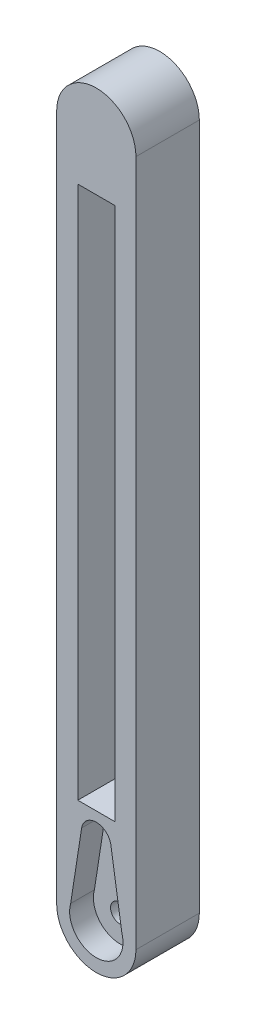
ISO-10303-21;
HEADER;
FILE_DESCRIPTION(('STEP AP214'),'2;1');
FILE_NAME('part.step','',(''),(''),'','','');
FILE_SCHEMA(('AUTOMOTIVE_DESIGN { 1 0 10303 214 1 1 1 1 }'));
ENDSEC;
DATA;
#1=APPLICATION_CONTEXT('core data for automotive mechanical design processes');
#2=APPLICATION_PROTOCOL_DEFINITION('international standard','automotive_design',2000,#1);
#3=PRODUCT_CONTEXT('',#1,'mechanical');
#4=PRODUCT('Part','Part','',(#3));
#5=PRODUCT_RELATED_PRODUCT_CATEGORY('part','',(#4));
#6=PRODUCT_DEFINITION_FORMATION('','',#4);
#7=PRODUCT_DEFINITION_CONTEXT('part definition',#1,'design');
#8=PRODUCT_DEFINITION('design','',#6,#7);
#9=PRODUCT_DEFINITION_SHAPE('','',#8);
#10=(LENGTH_UNIT() NAMED_UNIT(*) SI_UNIT(.MILLI.,.METRE.));
#11=(NAMED_UNIT(*) PLANE_ANGLE_UNIT() SI_UNIT($,.RADIAN.));
#12=(NAMED_UNIT(*) SI_UNIT($,.STERADIAN.) SOLID_ANGLE_UNIT());
#13=UNCERTAINTY_MEASURE_WITH_UNIT(LENGTH_MEASURE(1.E-05),#10,'distance_accuracy_value','');
#14=(GEOMETRIC_REPRESENTATION_CONTEXT(3) GLOBAL_UNCERTAINTY_ASSIGNED_CONTEXT((#13)) GLOBAL_UNIT_ASSIGNED_CONTEXT((#10,
#11,#12)) REPRESENTATION_CONTEXT('',''));
#15=CARTESIAN_POINT('',(0.,0.,0.));
#16=DIRECTION('',(0.,0.,1.));
#17=DIRECTION('',(1.,0.,0.));
#18=AXIS2_PLACEMENT_3D('',#15,#16,#17);
#19=CARTESIAN_POINT('',(1.85483870967741,-27.4193548387097,-1.5));
#20=DIRECTION('',(0.,0.,1.));
#21=DIRECTION('',(1.,0.,0.));
#22=AXIS2_PLACEMENT_3D('',#19,#20,#21);
#23=CYLINDRICAL_SURFACE('',#22,1.79999999999999);
#24=CARTESIAN_POINT('',(1.85483870967741,-27.4193548387097,7.5));
#25=DIRECTION('',(0.,0.,1.));
#26=DIRECTION('',(1.,0.,0.));
#27=AXIS2_PLACEMENT_3D('',#24,#25,#26);
#28=CIRCLE('',#27,1.79999999999999);
#29=CARTESIAN_POINT('',(3.65483870967741,-27.4193548387097,7.5));
#30=VERTEX_POINT('',#29);
#31=EDGE_CURVE('E167',#30,#30,#28,.T.);
#32=ORIENTED_EDGE('',*,*,#31,.T.);
#33=EDGE_LOOP('',(#32));
#34=FACE_BOUND('',#33,.T.);
#35=CARTESIAN_POINT('',(1.85483870967741,-27.4193548387097,2.));
#36=DIRECTION('',(0.,0.,-1.));
#37=DIRECTION('',(-1.,0.,0.));
#38=AXIS2_PLACEMENT_3D('',#35,#36,#37);
#39=CIRCLE('',#38,1.79999999999999);
#40=CARTESIAN_POINT('',(0.0548387096774171,-27.4193548387097,2.));
#41=VERTEX_POINT('',#40);
#42=EDGE_CURVE('E49',#41,#41,#39,.F.);
#43=ORIENTED_EDGE('',*,*,#42,.F.);
#44=EDGE_LOOP('',(#43));
#45=FACE_BOUND('',#44,.T.);
#46=ADVANCED_FACE('F45',(#34,#45),#23,.F.);
#47=CARTESIAN_POINT('',(1.85483870967741,102.58064516129,12.));
#48=DIRECTION('',(0.,0.,-1.));
#49=DIRECTION('',(-1.,0.,0.));
#50=AXIS2_PLACEMENT_3D('',#47,#48,#49);
#51=CYLINDRICAL_SURFACE('',#50,7.5);
#52=CARTESIAN_POINT('',(1.85483870967741,102.58064516129,0.));
#53=DIRECTION('',(0.,0.,1.));
#54=DIRECTION('',(-1.,0.,0.));
#55=AXIS2_PLACEMENT_3D('',#52,#53,#54);
#56=CIRCLE('',#55,7.5);
#57=CARTESIAN_POINT('',(9.35483870967741,102.58064516129,0.));
#58=VERTEX_POINT('',#57);
#59=CARTESIAN_POINT('',(-5.64516129032259,102.58064516129,0.));
#60=VERTEX_POINT('',#59);
#61=EDGE_CURVE('E248',#58,#60,#56,.T.);
#62=ORIENTED_EDGE('',*,*,#61,.T.);
#63=DIRECTION('',(0.,0.,-1.));
#64=VECTOR('',#63,1.);
#65=CARTESIAN_POINT('',(-5.64516129032259,102.58064516129,12.));
#66=LINE('',#65,#64);
#67=CARTESIAN_POINT('',(-5.64516129032259,102.58064516129,12.));
#68=VERTEX_POINT('',#67);
#69=EDGE_CURVE('E55',#68,#60,#66,.T.);
#70=ORIENTED_EDGE('',*,*,#69,.F.);
#71=CARTESIAN_POINT('',(1.85483870967741,102.58064516129,12.));
#72=DIRECTION('',(0.,0.,1.));
#73=DIRECTION('',(-1.,0.,0.));
#74=AXIS2_PLACEMENT_3D('',#71,#72,#73);
#75=CIRCLE('',#74,7.5);
#76=CARTESIAN_POINT('',(9.35483870967741,102.58064516129,12.));
#77=VERTEX_POINT('',#76);
#78=EDGE_CURVE('E252',#77,#68,#75,.T.);
#79=ORIENTED_EDGE('',*,*,#78,.F.);
#80=DIRECTION('',(0.,0.,-1.));
#81=VECTOR('',#80,1.);
#82=CARTESIAN_POINT('',(9.35483870967741,102.58064516129,12.));
#83=LINE('',#82,#81);
#84=EDGE_CURVE('E266',#77,#58,#83,.T.);
#85=ORIENTED_EDGE('',*,*,#84,.T.);
#86=EDGE_LOOP('',(#62,#70,#79,#85));
#87=FACE_BOUND('',#86,.T.);
#88=ADVANCED_FACE('F47',(#87),#51,.T.);
#89=CARTESIAN_POINT('',(-5.64516129032259,102.58064516129,12.));
#90=DIRECTION('',(1.,0.,0.));
#91=DIRECTION('',(0.,1.,0.));
#92=AXIS2_PLACEMENT_3D('',#89,#90,#91);
#93=PLANE('',#92);
#94=CARTESIAN_POINT('',(-5.64516129032259,78.768969581459,6.));
#95=DIRECTION('',(-1.,0.,0.));
#96=DIRECTION('',(0.,-1.,0.));
#97=AXIS2_PLACEMENT_3D('',#94,#95,#96);
#98=CIRCLE('',#97,5.15);
#99=CARTESIAN_POINT('',(-5.64516129032259,73.618969581459,6.));
#100=VERTEX_POINT('',#99);
#101=EDGE_CURVE('E206',#100,#100,#98,.T.);
#102=ORIENTED_EDGE('',*,*,#101,.F.);
#103=EDGE_LOOP('',(#102));
#104=FACE_BOUND('',#103,.T.);
#105=CARTESIAN_POINT('',(-5.64516129032258,53.768969581459,6.00000000000026));
#106=DIRECTION('',(-1.,0.,0.));
#107=DIRECTION('',(0.,-1.,0.));
#108=AXIS2_PLACEMENT_3D('',#105,#106,#107);
#109=CIRCLE('',#108,5.15);
#110=CARTESIAN_POINT('',(-5.64516129032258,48.618969581459,6.00000000000026));
#111=VERTEX_POINT('',#110);
#112=EDGE_CURVE('E210',#111,#111,#109,.T.);
#113=ORIENTED_EDGE('',*,*,#112,.F.);
#114=EDGE_LOOP('',(#113));
#115=FACE_BOUND('',#114,.T.);
#116=CARTESIAN_POINT('',(-5.64516129032258,28.768969581459,6.00000000000052));
#117=DIRECTION('',(-1.,0.,0.));
#118=DIRECTION('',(0.,-1.,0.));
#119=AXIS2_PLACEMENT_3D('',#116,#117,#118);
#120=CIRCLE('',#119,5.15);
#121=CARTESIAN_POINT('',(-5.64516129032258,23.618969581459,6.00000000000052));
#122=VERTEX_POINT('',#121);
#123=EDGE_CURVE('E218',#122,#122,#120,.T.);
#124=ORIENTED_EDGE('',*,*,#123,.F.);
#125=EDGE_LOOP('',(#124));
#126=FACE_BOUND('',#125,.T.);
#127=DIRECTION('',(0.,-1.,0.));
#128=VECTOR('',#127,1.);
#129=CARTESIAN_POINT('',(-5.64516129032259,102.58064516129,0.));
#130=LINE('',#129,#128);
#131=CARTESIAN_POINT('',(-5.64516129032258,-27.4193548387097,0.));
#132=VERTEX_POINT('',#131);
#133=EDGE_CURVE('E270',#60,#132,#130,.T.);
#134=ORIENTED_EDGE('',*,*,#133,.T.);
#135=DIRECTION('',(0.,0.,-1.));
#136=VECTOR('',#135,1.);
#137=CARTESIAN_POINT('',(-5.64516129032258,-27.4193548387097,12.));
#138=LINE('',#137,#136);
#139=CARTESIAN_POINT('',(-5.64516129032258,-27.4193548387097,12.));
#140=VERTEX_POINT('',#139);
#141=EDGE_CURVE('E285',#140,#132,#138,.T.);
#142=ORIENTED_EDGE('',*,*,#141,.F.);
#143=DIRECTION('',(0.,-1.,0.));
#144=VECTOR('',#143,1.);
#145=CARTESIAN_POINT('',(-5.64516129032259,102.58064516129,12.));
#146=LINE('',#145,#144);
#147=EDGE_CURVE('E256',#68,#140,#146,.T.);
#148=ORIENTED_EDGE('',*,*,#147,.F.);
#149=ORIENTED_EDGE('',*,*,#69,.T.);
#150=EDGE_LOOP('',(#134,#142,#148,#149));
#151=FACE_BOUND('',#150,.T.);
#152=ADVANCED_FACE('F293',(#104,#115,#126,#151),#93,.F.);
#153=CARTESIAN_POINT('',(1.85483870967743,-27.4193548387097,12.));
#154=DIRECTION('',(0.,0.,-1.));
#155=DIRECTION('',(-1.,0.,0.));
#156=AXIS2_PLACEMENT_3D('',#153,#154,#155);
#157=CYLINDRICAL_SURFACE('',#156,7.5);
#158=CARTESIAN_POINT('',(1.85483870967743,-27.4193548387097,0.));
#159=DIRECTION('',(0.,0.,1.));
#160=DIRECTION('',(1.,0.,0.));
#161=AXIS2_PLACEMENT_3D('',#158,#159,#160);
#162=CIRCLE('',#161,7.5);
#163=CARTESIAN_POINT('',(9.35483870967743,-27.4193548387097,0.));
#164=VERTEX_POINT('',#163);
#165=EDGE_CURVE('E273',#132,#164,#162,.T.);
#166=ORIENTED_EDGE('',*,*,#165,.T.);
#167=DIRECTION('',(0.,0.,-1.));
#168=VECTOR('',#167,1.);
#169=CARTESIAN_POINT('',(9.35483870967743,-27.4193548387097,12.));
#170=LINE('',#169,#168);
#171=CARTESIAN_POINT('',(9.35483870967743,-27.4193548387097,12.));
#172=VERTEX_POINT('',#171);
#173=EDGE_CURVE('E281',#172,#164,#170,.T.);
#174=ORIENTED_EDGE('',*,*,#173,.F.);
#175=CARTESIAN_POINT('',(1.85483870967743,-27.4193548387097,12.));
#176=DIRECTION('',(0.,0.,1.));
#177=DIRECTION('',(1.,0.,0.));
#178=AXIS2_PLACEMENT_3D('',#175,#176,#177);
#179=CIRCLE('',#178,7.5);
#180=EDGE_CURVE('E260',#140,#172,#179,.T.);
#181=ORIENTED_EDGE('',*,*,#180,.F.);
#182=ORIENTED_EDGE('',*,*,#141,.T.);
#183=EDGE_LOOP('',(#166,#174,#181,#182));
#184=FACE_BOUND('',#183,.T.);
#185=ADVANCED_FACE('F305',(#184),#157,.T.);
#186=CARTESIAN_POINT('',(9.35483870967741,102.58064516129,12.));
#187=DIRECTION('',(-1.,0.,0.));
#188=DIRECTION('',(0.,-1.,0.));
#189=AXIS2_PLACEMENT_3D('',#186,#187,#188);
#190=PLANE('',#189);
#191=DIRECTION('',(0.,1.,0.));
#192=VECTOR('',#191,1.);
#193=CARTESIAN_POINT('',(9.35483870967741,102.58064516129,0.));
#194=LINE('',#193,#192);
#195=EDGE_CURVE('E257',#164,#58,#194,.T.);
#196=ORIENTED_EDGE('',*,*,#195,.T.);
#197=ORIENTED_EDGE('',*,*,#84,.F.);
#198=DIRECTION('',(0.,1.,0.));
#199=VECTOR('',#198,1.);
#200=CARTESIAN_POINT('',(9.35483870967741,102.58064516129,12.));
#201=LINE('',#200,#199);
#202=EDGE_CURVE('E263',#172,#77,#201,.T.);
#203=ORIENTED_EDGE('',*,*,#202,.F.);
#204=ORIENTED_EDGE('',*,*,#173,.T.);
#205=EDGE_LOOP('',(#196,#197,#203,#204));
#206=FACE_BOUND('',#205,.T.);
#207=ADVANCED_FACE('F309',(#206),#190,.F.);
#208=CARTESIAN_POINT('',(1.85483870967741,102.58064516129,12.));
#209=DIRECTION('',(0.,0.,-1.));
#210=DIRECTION('',(-1.,0.,0.));
#211=AXIS2_PLACEMENT_3D('',#208,#209,#210);
#212=PLANE('',#211);
#213=DIRECTION('',(-0.153902862320071,0.988085982579294,0.));
#214=VECTOR('',#213,1.);
#215=CARTESIAN_POINT('',(6.69378472408306,-25.9617166517751,12.));
#216=LINE('',#215,#214);
#217=CARTESIAN_POINT('',(6.69378472408305,-25.9617166517751,12.));
#218=VERTEX_POINT('',#217);
#219=CARTESIAN_POINT('',(4.61141033989819,-12.5924725163662,12.));
#220=VERTEX_POINT('',#219);
#221=EDGE_CURVE('E176',#218,#220,#216,.T.);
#222=ORIENTED_EDGE('',*,*,#221,.F.);
#223=CARTESIAN_POINT('',(1.85483870967741,-27.4193548387097,12.));
#224=DIRECTION('',(0.,0.,1.));
#225=DIRECTION('',(1.,0.,0.));
#226=AXIS2_PLACEMENT_3D('',#223,#224,#225);
#227=CIRCLE('',#226,5.05372215444639);
#228=CARTESIAN_POINT('',(-2.99728743113241,-26.0062095779484,12.));
#229=VERTEX_POINT('',#228);
#230=EDGE_CURVE('E62',#229,#218,#227,.T.);
#231=ORIENTED_EDGE('',*,*,#230,.F.);
#232=DIRECTION('',(-0.152980997004391,-0.98822913059449,0.));
#233=VECTOR('',#232,1.);
#234=CARTESIAN_POINT('',(-0.920798481650618,-12.592472516367,12.));
#235=LINE('',#234,#233);
#236=CARTESIAN_POINT('',(-0.920798481650618,-12.592472516367,12.));
#237=VERTEX_POINT('',#236);
#238=EDGE_CURVE('E160',#237,#229,#235,.T.);
#239=ORIENTED_EDGE('',*,*,#238,.F.);
#240=CARTESIAN_POINT('',(1.84530592912386,-13.0759545909326,12.));
#241=DIRECTION('',(0.,0.,1.));
#242=DIRECTION('',(1.,0.,0.));
#243=AXIS2_PLACEMENT_3D('',#240,#241,#242);
#244=CIRCLE('',#243,2.80803997972469);
#245=EDGE_CURVE('E164',#220,#237,#244,.T.);
#246=ORIENTED_EDGE('',*,*,#245,.F.);
#247=EDGE_LOOP('',(#222,#231,#239,#246));
#248=FACE_BOUND('',#247,.T.);
#249=DIRECTION('',(-1.,0.,0.));
#250=VECTOR('',#249,1.);
#251=CARTESIAN_POINT('',(-2.3762908371189,-8.41500935941688,12.));
#252=LINE('',#251,#250);
#253=CARTESIAN_POINT('',(5.35483870967741,-8.41500935941688,12.));
#254=VERTEX_POINT('',#253);
#255=CARTESIAN_POINT('',(-1.64516129032259,-8.41500935941689,12.));
#256=VERTEX_POINT('',#255);
#257=EDGE_CURVE('E185',#254,#256,#252,.T.);
#258=ORIENTED_EDGE('',*,*,#257,.T.);
#259=DIRECTION('',(0.,-1.,0.));
#260=VECTOR('',#259,1.);
#261=CARTESIAN_POINT('',(-1.64516129032259,92.5806451612903,12.));
#262=LINE('',#261,#260);
#263=CARTESIAN_POINT('',(-1.64516129032259,92.5806451612903,12.));
#264=VERTEX_POINT('',#263);
#265=EDGE_CURVE('E229',#264,#256,#262,.T.);
#266=ORIENTED_EDGE('',*,*,#265,.F.);
#267=DIRECTION('',(-1.,0.,0.));
#268=VECTOR('',#267,1.);
#269=CARTESIAN_POINT('',(-1.64516129032259,92.5806451612903,12.));
#270=LINE('',#269,#268);
#271=CARTESIAN_POINT('',(5.35483870967741,92.5806451612903,12.));
#272=VERTEX_POINT('',#271);
#273=EDGE_CURVE('E239',#272,#264,#270,.T.);
#274=ORIENTED_EDGE('',*,*,#273,.F.);
#275=DIRECTION('',(0.,1.,0.));
#276=VECTOR('',#275,1.);
#277=CARTESIAN_POINT('',(5.35483870967741,92.5806451612903,12.));
#278=LINE('',#277,#276);
#279=EDGE_CURVE('E205',#254,#272,#278,.T.);
#280=ORIENTED_EDGE('',*,*,#279,.F.);
#281=EDGE_LOOP('',(#258,#266,#274,#280));
#282=FACE_BOUND('',#281,.T.);
#283=ORIENTED_EDGE('',*,*,#78,.T.);
#284=ORIENTED_EDGE('',*,*,#147,.T.);
#285=ORIENTED_EDGE('',*,*,#180,.T.);
#286=ORIENTED_EDGE('',*,*,#202,.T.);
#287=EDGE_LOOP('',(#283,#284,#285,#286));
#288=FACE_BOUND('',#287,.T.);
#289=ADVANCED_FACE('F311',(#248,#282,#288),#212,.F.);
#290=CARTESIAN_POINT('',(1.85483870967741,102.58064516129,0.));
#291=DIRECTION('',(0.,0.,-1.));
#292=DIRECTION('',(-1.,0.,0.));
#293=AXIS2_PLACEMENT_3D('',#290,#291,#292);
#294=PLANE('',#293);
#295=CARTESIAN_POINT('',(1.85483870967741,-27.4193548387097,0.));
#296=DIRECTION('',(0.,0.,-1.));
#297=DIRECTION('',(-1.,0.,0.));
#298=AXIS2_PLACEMENT_3D('',#295,#296,#297);
#299=CIRCLE('',#298,2.25);
#300=CARTESIAN_POINT('',(-0.395161290322588,-27.4193548387097,0.));
#301=VERTEX_POINT('',#300);
#302=EDGE_CURVE('E473',#301,#301,#299,.T.);
#303=ORIENTED_EDGE('',*,*,#302,.F.);
#304=EDGE_LOOP('',(#303));
#305=FACE_BOUND('',#304,.T.);
#306=DIRECTION('',(0.,-1.,0.));
#307=VECTOR('',#306,1.);
#308=CARTESIAN_POINT('',(-1.64516129032259,92.5806451612903,0.));
#309=LINE('',#308,#307);
#310=CARTESIAN_POINT('',(-1.64516129032259,92.5806451612903,0.));
#311=VERTEX_POINT('',#310);
#312=CARTESIAN_POINT('',(-1.64516129032259,-8.41500935941689,0.));
#313=VERTEX_POINT('',#312);
#314=EDGE_CURVE('E233',#311,#313,#309,.T.);
#315=ORIENTED_EDGE('',*,*,#314,.T.);
#316=DIRECTION('',(-1.,0.,0.));
#317=VECTOR('',#316,1.);
#318=CARTESIAN_POINT('',(-2.3762908371189,-8.41500935941688,0.));
#319=LINE('',#318,#317);
#320=CARTESIAN_POINT('',(5.35483870967741,-8.41500935941689,0.));
#321=VERTEX_POINT('',#320);
#322=EDGE_CURVE('E191',#321,#313,#319,.T.);
#323=ORIENTED_EDGE('',*,*,#322,.F.);
#324=DIRECTION('',(0.,1.,0.));
#325=VECTOR('',#324,1.);
#326=CARTESIAN_POINT('',(5.35483870967741,92.5806451612903,0.));
#327=LINE('',#326,#325);
#328=CARTESIAN_POINT('',(5.35483870967741,92.5806451612903,0.));
#329=VERTEX_POINT('',#328);
#330=EDGE_CURVE('E225',#321,#329,#327,.T.);
#331=ORIENTED_EDGE('',*,*,#330,.T.);
#332=DIRECTION('',(-1.,0.,0.));
#333=VECTOR('',#332,1.);
#334=CARTESIAN_POINT('',(-1.64516129032259,92.5806451612903,0.));
#335=LINE('',#334,#333);
#336=EDGE_CURVE('E228',#329,#311,#335,.T.);
#337=ORIENTED_EDGE('',*,*,#336,.T.);
#338=EDGE_LOOP('',(#315,#323,#331,#337));
#339=FACE_BOUND('',#338,.T.);
#340=ORIENTED_EDGE('',*,*,#61,.F.);
#341=ORIENTED_EDGE('',*,*,#195,.F.);
#342=ORIENTED_EDGE('',*,*,#165,.F.);
#343=ORIENTED_EDGE('',*,*,#133,.F.);
#344=EDGE_LOOP('',(#340,#341,#342,#343));
#345=FACE_BOUND('',#344,.T.);
#346=ADVANCED_FACE('F301',(#305,#339,#345),#294,.T.);
#347=CARTESIAN_POINT('',(-1.64516129032259,92.5806451612903,0.));
#348=DIRECTION('',(-1.,0.,0.));
#349=DIRECTION('',(0.,-1.,0.));
#350=AXIS2_PLACEMENT_3D('',#347,#348,#349);
#351=PLANE('',#350);
#352=ORIENTED_EDGE('',*,*,#265,.T.);
#353=DIRECTION('',(0.,0.,-1.));
#354=VECTOR('',#353,1.);
#355=CARTESIAN_POINT('',(-1.64516129032259,-8.41500935941689,0.));
#356=LINE('',#355,#354);
#357=EDGE_CURVE('E70',#256,#313,#356,.T.);
#358=ORIENTED_EDGE('',*,*,#357,.T.);
#359=ORIENTED_EDGE('',*,*,#314,.F.);
#360=DIRECTION('',(0.,0.,1.));
#361=VECTOR('',#360,1.);
#362=CARTESIAN_POINT('',(-1.64516129032259,92.5806451612903,0.));
#363=LINE('',#362,#361);
#364=EDGE_CURVE('E245',#311,#264,#363,.T.);
#365=ORIENTED_EDGE('',*,*,#364,.T.);
#366=EDGE_LOOP('',(#352,#358,#359,#365));
#367=FACE_BOUND('',#366,.T.);
#368=ADVANCED_FACE('F320',(#367),#351,.F.);
#369=CARTESIAN_POINT('',(-1.64516129032259,92.5806451612903,0.));
#370=DIRECTION('',(0.,1.,0.));
#371=DIRECTION('',(0.,0.,1.));
#372=AXIS2_PLACEMENT_3D('',#369,#370,#371);
#373=PLANE('',#372);
#374=ORIENTED_EDGE('',*,*,#273,.T.);
#375=ORIENTED_EDGE('',*,*,#364,.F.);
#376=ORIENTED_EDGE('',*,*,#336,.F.);
#377=DIRECTION('',(0.,0.,1.));
#378=VECTOR('',#377,1.);
#379=CARTESIAN_POINT('',(5.35483870967741,92.5806451612903,0.));
#380=LINE('',#379,#378);
#381=EDGE_CURVE('E236',#329,#272,#380,.T.);
#382=ORIENTED_EDGE('',*,*,#381,.T.);
#383=EDGE_LOOP('',(#374,#375,#376,#382));
#384=FACE_BOUND('',#383,.T.);
#385=ADVANCED_FACE('F384',(#384),#373,.F.);
#386=CARTESIAN_POINT('',(5.35483870967741,92.5806451612903,0.));
#387=DIRECTION('',(1.,0.,0.));
#388=DIRECTION('',(0.,0.,-1.));
#389=AXIS2_PLACEMENT_3D('',#386,#387,#388);
#390=PLANE('',#389);
#391=ORIENTED_EDGE('',*,*,#330,.F.);
#392=DIRECTION('',(0.,0.,1.));
#393=VECTOR('',#392,1.);
#394=CARTESIAN_POINT('',(5.35483870967741,-8.41500935941689,0.));
#395=LINE('',#394,#393);
#396=EDGE_CURVE('E11',#321,#254,#395,.T.);
#397=ORIENTED_EDGE('',*,*,#396,.T.);
#398=ORIENTED_EDGE('',*,*,#279,.T.);
#399=ORIENTED_EDGE('',*,*,#381,.F.);
#400=EDGE_LOOP('',(#391,#397,#398,#399));
#401=FACE_BOUND('',#400,.T.);
#402=ADVANCED_FACE('F377',(#401),#390,.F.);
#403=CARTESIAN_POINT('',(-3.64516129032258,28.768969581459,6.00000000000052));
#404=DIRECTION('',(-1.,0.,0.));
#405=DIRECTION('',(0.,-1.,0.));
#406=AXIS2_PLACEMENT_3D('',#403,#404,#405);
#407=CYLINDRICAL_SURFACE('',#406,5.15);
#408=CARTESIAN_POINT('',(-3.64516129032258,28.768969581459,6.00000000000052));
#409=DIRECTION('',(-1.,0.,0.));
#410=DIRECTION('',(0.,-1.,0.));
#411=AXIS2_PLACEMENT_3D('',#408,#409,#410);
#412=CIRCLE('',#411,5.15);
#413=CARTESIAN_POINT('',(-3.64516129032258,23.618969581459,6.00000000000052));
#414=VERTEX_POINT('',#413);
#415=EDGE_CURVE('E200',#414,#414,#412,.T.);
#416=ORIENTED_EDGE('',*,*,#415,.F.);
#417=EDGE_LOOP('',(#416));
#418=FACE_BOUND('',#417,.T.);
#419=ORIENTED_EDGE('',*,*,#123,.T.);
#420=EDGE_LOOP('',(#419));
#421=FACE_BOUND('',#420,.T.);
#422=ADVANCED_FACE('F374',(#418,#421),#407,.F.);
#423=CARTESIAN_POINT('',(-3.64516129032258,28.768969581459,6.00000000000052));
#424=DIRECTION('',(-1.,0.,0.));
#425=DIRECTION('',(0.,-1.,0.));
#426=AXIS2_PLACEMENT_3D('',#423,#424,#425);
#427=PLANE('',#426);
#428=ORIENTED_EDGE('',*,*,#415,.T.);
#429=EDGE_LOOP('',(#428));
#430=FACE_BOUND('',#429,.T.);
#431=ADVANCED_FACE('F369',(#430),#427,.T.);
#432=CARTESIAN_POINT('',(-3.64516129032258,53.768969581459,6.00000000000026));
#433=DIRECTION('',(-1.,0.,0.));
#434=DIRECTION('',(0.,-1.,0.));
#435=AXIS2_PLACEMENT_3D('',#432,#433,#434);
#436=CYLINDRICAL_SURFACE('',#435,5.15);
#437=CARTESIAN_POINT('',(-3.64516129032258,53.768969581459,6.00000000000026));
#438=DIRECTION('',(-1.,0.,0.));
#439=DIRECTION('',(0.,-1.,0.));
#440=AXIS2_PLACEMENT_3D('',#437,#438,#439);
#441=CIRCLE('',#440,5.15);
#442=CARTESIAN_POINT('',(-3.64516129032258,48.618969581459,6.00000000000026));
#443=VERTEX_POINT('',#442);
#444=EDGE_CURVE('E214',#443,#443,#441,.T.);
#445=ORIENTED_EDGE('',*,*,#444,.F.);
#446=EDGE_LOOP('',(#445));
#447=FACE_BOUND('',#446,.T.);
#448=ORIENTED_EDGE('',*,*,#112,.T.);
#449=EDGE_LOOP('',(#448));
#450=FACE_BOUND('',#449,.T.);
#451=ADVANCED_FACE('F366',(#447,#450),#436,.F.);
#452=CARTESIAN_POINT('',(-3.64516129032258,53.768969581459,6.00000000000026));
#453=DIRECTION('',(-1.,0.,0.));
#454=DIRECTION('',(0.,-1.,0.));
#455=AXIS2_PLACEMENT_3D('',#452,#453,#454);
#456=PLANE('',#455);
#457=ORIENTED_EDGE('',*,*,#444,.T.);
#458=EDGE_LOOP('',(#457));
#459=FACE_BOUND('',#458,.T.);
#460=ADVANCED_FACE('F364',(#459),#456,.T.);
#461=CARTESIAN_POINT('',(-3.64516129032259,78.768969581459,6.));
#462=DIRECTION('',(-1.,0.,0.));
#463=DIRECTION('',(0.,-1.,0.));
#464=AXIS2_PLACEMENT_3D('',#461,#462,#463);
#465=CYLINDRICAL_SURFACE('',#464,5.15);
#466=CARTESIAN_POINT('',(-3.64516129032259,78.768969581459,6.));
#467=DIRECTION('',(-1.,0.,0.));
#468=DIRECTION('',(0.,-1.,0.));
#469=AXIS2_PLACEMENT_3D('',#466,#467,#468);
#470=CIRCLE('',#469,5.15);
#471=CARTESIAN_POINT('',(-3.64516129032259,73.618969581459,6.));
#472=VERTEX_POINT('',#471);
#473=EDGE_CURVE('E201',#472,#472,#470,.T.);
#474=ORIENTED_EDGE('',*,*,#473,.F.);
#475=EDGE_LOOP('',(#474));
#476=FACE_BOUND('',#475,.T.);
#477=ORIENTED_EDGE('',*,*,#101,.T.);
#478=EDGE_LOOP('',(#477));
#479=FACE_BOUND('',#478,.T.);
#480=ADVANCED_FACE('F360',(#476,#479),#465,.F.);
#481=CARTESIAN_POINT('',(-3.64516129032259,78.768969581459,6.));
#482=DIRECTION('',(-1.,0.,0.));
#483=DIRECTION('',(0.,-1.,0.));
#484=AXIS2_PLACEMENT_3D('',#481,#482,#483);
#485=PLANE('',#484);
#486=ORIENTED_EDGE('',*,*,#473,.T.);
#487=EDGE_LOOP('',(#486));
#488=FACE_BOUND('',#487,.T.);
#489=ADVANCED_FACE('F356',(#488),#485,.T.);
#490=CARTESIAN_POINT('',(-2.3762908371189,-8.41500935941688,0.));
#491=DIRECTION('',(0.,1.,0.));
#492=DIRECTION('',(0.,0.,1.));
#493=AXIS2_PLACEMENT_3D('',#490,#491,#492);
#494=PLANE('',#493);
#495=ORIENTED_EDGE('',*,*,#357,.F.);
#496=ORIENTED_EDGE('',*,*,#257,.F.);
#497=ORIENTED_EDGE('',*,*,#396,.F.);
#498=ORIENTED_EDGE('',*,*,#322,.T.);
#499=EDGE_LOOP('',(#495,#496,#497,#498));
#500=FACE_BOUND('',#499,.T.);
#501=ADVANCED_FACE('F354',(#500),#494,.T.);
#502=CARTESIAN_POINT('',(1.85483870967741,-27.4193548387097,7.5));
#503=DIRECTION('',(0.,0.,1.));
#504=DIRECTION('',(1.,0.,0.));
#505=AXIS2_PLACEMENT_3D('',#502,#503,#504);
#506=CYLINDRICAL_SURFACE('',#505,5.05372215444639);
#507=ORIENTED_EDGE('',*,*,#230,.T.);
#508=DIRECTION('',(0.,0.,1.));
#509=VECTOR('',#508,1.);
#510=CARTESIAN_POINT('',(6.69378472408306,-25.9617166517751,7.5));
#511=LINE('',#510,#509);
#512=CARTESIAN_POINT('',(6.69378472408306,-25.9617166517751,7.5));
#513=VERTEX_POINT('',#512);
#514=EDGE_CURVE('E135',#513,#218,#511,.T.);
#515=ORIENTED_EDGE('',*,*,#514,.F.);
#516=CARTESIAN_POINT('',(1.85483870967741,-27.4193548387097,7.5));
#517=DIRECTION('',(0.,0.,1.));
#518=DIRECTION('',(1.,0.,0.));
#519=AXIS2_PLACEMENT_3D('',#516,#517,#518);
#520=CIRCLE('',#519,5.05372215444639);
#521=CARTESIAN_POINT('',(-2.99728743113241,-26.0062095779484,7.5));
#522=VERTEX_POINT('',#521);
#523=EDGE_CURVE('E139',#522,#513,#520,.T.);
#524=ORIENTED_EDGE('',*,*,#523,.F.);
#525=DIRECTION('',(0.,0.,1.));
#526=VECTOR('',#525,1.);
#527=CARTESIAN_POINT('',(-2.99728743113241,-26.0062095779484,7.5));
#528=LINE('',#527,#526);
#529=EDGE_CURVE('E182',#522,#229,#528,.T.);
#530=ORIENTED_EDGE('',*,*,#529,.T.);
#531=EDGE_LOOP('',(#507,#515,#524,#530));
#532=FACE_BOUND('',#531,.T.);
#533=ADVANCED_FACE('F137',(#532),#506,.F.);
#534=CARTESIAN_POINT('',(-0.920798481650618,-12.592472516367,7.5));
#535=DIRECTION('',(-0.98822913059449,0.152980997004391,0.));
#536=DIRECTION('',(-0.152980997004391,-0.988229130594491,0.));
#537=AXIS2_PLACEMENT_3D('',#534,#535,#536);
#538=PLANE('',#537);
#539=ORIENTED_EDGE('',*,*,#238,.T.);
#540=ORIENTED_EDGE('',*,*,#529,.F.);
#541=DIRECTION('',(-0.152980997004391,-0.98822913059449,0.));
#542=VECTOR('',#541,1.);
#543=CARTESIAN_POINT('',(-0.920798481650618,-12.592472516367,7.5));
#544=LINE('',#543,#542);
#545=CARTESIAN_POINT('',(-0.920798481650618,-12.592472516367,7.5));
#546=VERTEX_POINT('',#545);
#547=EDGE_CURVE('E146',#546,#522,#544,.T.);
#548=ORIENTED_EDGE('',*,*,#547,.F.);
#549=DIRECTION('',(0.,0.,1.));
#550=VECTOR('',#549,1.);
#551=CARTESIAN_POINT('',(-0.920798481650618,-12.592472516367,7.5));
#552=LINE('',#551,#550);
#553=EDGE_CURVE('E186',#546,#237,#552,.T.);
#554=ORIENTED_EDGE('',*,*,#553,.T.);
#555=EDGE_LOOP('',(#539,#540,#548,#554));
#556=FACE_BOUND('',#555,.T.);
#557=ADVANCED_FACE('F343',(#556),#538,.F.);
#558=CARTESIAN_POINT('',(1.84530592912386,-13.0759545909326,7.5));
#559=DIRECTION('',(0.,0.,1.));
#560=DIRECTION('',(1.,0.,0.));
#561=AXIS2_PLACEMENT_3D('',#558,#559,#560);
#562=CYLINDRICAL_SURFACE('',#561,2.80803997972469);
#563=ORIENTED_EDGE('',*,*,#245,.T.);
#564=ORIENTED_EDGE('',*,*,#553,.F.);
#565=CARTESIAN_POINT('',(1.84530592912386,-13.0759545909326,7.5));
#566=DIRECTION('',(0.,0.,1.));
#567=DIRECTION('',(1.,0.,0.));
#568=AXIS2_PLACEMENT_3D('',#565,#566,#567);
#569=CIRCLE('',#568,2.80803997972469);
#570=CARTESIAN_POINT('',(4.61141033989819,-12.5924725163662,7.5));
#571=VERTEX_POINT('',#570);
#572=EDGE_CURVE('E155',#571,#546,#569,.T.);
#573=ORIENTED_EDGE('',*,*,#572,.F.);
#574=DIRECTION('',(0.,0.,1.));
#575=VECTOR('',#574,1.);
#576=CARTESIAN_POINT('',(4.61141033989819,-12.5924725163662,7.5));
#577=LINE('',#576,#575);
#578=EDGE_CURVE('E145',#571,#220,#577,.T.);
#579=ORIENTED_EDGE('',*,*,#578,.T.);
#580=EDGE_LOOP('',(#563,#564,#573,#579));
#581=FACE_BOUND('',#580,.T.);
#582=ADVANCED_FACE('F346',(#581),#562,.F.);
#583=CARTESIAN_POINT('',(6.69378472408306,-25.9617166517751,7.5));
#584=DIRECTION('',(0.988085982579294,0.153902862320071,0.));
#585=DIRECTION('',(-0.153902862320071,0.988085982579294,0.));
#586=AXIS2_PLACEMENT_3D('',#583,#584,#585);
#587=PLANE('',#586);
#588=ORIENTED_EDGE('',*,*,#221,.T.);
#589=ORIENTED_EDGE('',*,*,#578,.F.);
#590=DIRECTION('',(-0.153902862320071,0.988085982579294,0.));
#591=VECTOR('',#590,1.);
#592=CARTESIAN_POINT('',(6.69378472408306,-25.9617166517751,7.5));
#593=LINE('',#592,#591);
#594=EDGE_CURVE('E149',#513,#571,#593,.T.);
#595=ORIENTED_EDGE('',*,*,#594,.F.);
#596=ORIENTED_EDGE('',*,*,#514,.T.);
#597=EDGE_LOOP('',(#588,#589,#595,#596));
#598=FACE_BOUND('',#597,.T.);
#599=ADVANCED_FACE('F150',(#598),#587,.F.);
#600=CARTESIAN_POINT('',(1.85483870967741,-27.4193548387097,7.5));
#601=DIRECTION('',(0.,0.,1.));
#602=DIRECTION('',(1.,0.,0.));
#603=AXIS2_PLACEMENT_3D('',#600,#601,#602);
#604=PLANE('',#603);
#605=ORIENTED_EDGE('',*,*,#31,.F.);
#606=EDGE_LOOP('',(#605));
#607=FACE_BOUND('',#606,.T.);
#608=ORIENTED_EDGE('',*,*,#523,.T.);
#609=ORIENTED_EDGE('',*,*,#594,.T.);
#610=ORIENTED_EDGE('',*,*,#572,.T.);
#611=ORIENTED_EDGE('',*,*,#547,.T.);
#612=EDGE_LOOP('',(#608,#609,#610,#611));
#613=FACE_BOUND('',#612,.T.);
#614=ADVANCED_FACE('F157',(#607,#613),#604,.T.);
#615=CARTESIAN_POINT('',(1.85483870967741,-27.4193548387097,2.));
#616=DIRECTION('',(0.,0.,-1.));
#617=DIRECTION('',(-1.,0.,0.));
#618=AXIS2_PLACEMENT_3D('',#615,#616,#617);
#619=PLANE('',#618);
#620=CARTESIAN_POINT('',(1.85483870967741,-27.4193548387097,2.));
#621=DIRECTION('',(0.,0.,-1.));
#622=DIRECTION('',(-1.,0.,0.));
#623=AXIS2_PLACEMENT_3D('',#620,#621,#622);
#624=CIRCLE('',#623,2.25);
#625=CARTESIAN_POINT('',(-0.395161290322588,-27.4193548387097,2.));
#626=VERTEX_POINT('',#625);
#627=EDGE_CURVE('E470',#626,#626,#624,.T.);
#628=ORIENTED_EDGE('',*,*,#627,.T.);
#629=EDGE_LOOP('',(#628));
#630=FACE_BOUND('',#629,.T.);
#631=ORIENTED_EDGE('',*,*,#42,.T.);
#632=EDGE_LOOP('',(#631));
#633=FACE_BOUND('',#632,.T.);
#634=ADVANCED_FACE('F341',(#630,#633),#619,.T.);
#635=CARTESIAN_POINT('',(1.85483870967741,-27.4193548387097,2.));
#636=DIRECTION('',(0.,0.,-1.));
#637=DIRECTION('',(-1.,0.,0.));
#638=AXIS2_PLACEMENT_3D('',#635,#636,#637);
#639=CYLINDRICAL_SURFACE('',#638,2.25);
#640=ORIENTED_EDGE('',*,*,#627,.F.);
#641=EDGE_LOOP('',(#640));
#642=FACE_BOUND('',#641,.T.);
#643=ORIENTED_EDGE('',*,*,#302,.T.);
#644=EDGE_LOOP('',(#643));
#645=FACE_BOUND('',#644,.T.);
#646=ADVANCED_FACE('F338',(#642,#645),#639,.F.);
#647=CLOSED_SHELL('',(#46,#88,#152,#185,#207,#289,#346,#368,#385,#402,#422,#431,#451,#460,#480,
#489,#501,#533,#557,#582,#599,#614,#634,#646));
#648=MANIFOLD_SOLID_BREP('B2',#647);
#649=ADVANCED_BREP_SHAPE_REPRESENTATION('',(#18,#648),#14);
#650=SHAPE_DEFINITION_REPRESENTATION(#9,#649);
ENDSEC;
END-ISO-10303-21;
